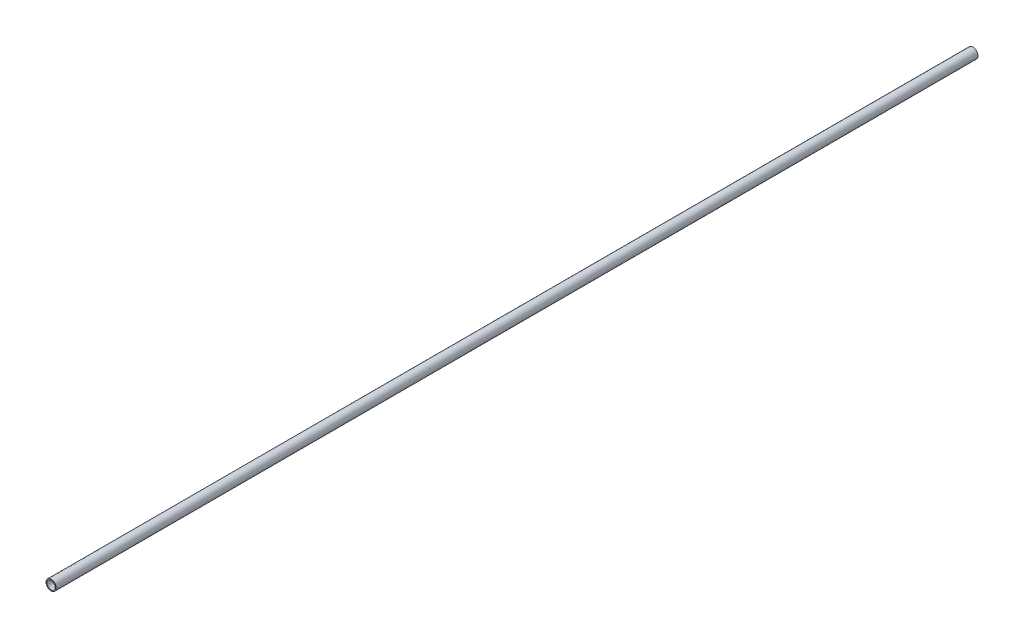
ISO-10303-21;
HEADER;
FILE_DESCRIPTION(('STEP AP214'),'2;1');
FILE_NAME('part.step','',(''),(''),'','','');
FILE_SCHEMA(('AUTOMOTIVE_DESIGN { 1 0 10303 214 1 1 1 1 }'));
ENDSEC;
DATA;
#1=APPLICATION_CONTEXT('core data for automotive mechanical design processes');
#2=APPLICATION_PROTOCOL_DEFINITION('international standard','automotive_design',2000,#1);
#3=PRODUCT_CONTEXT('',#1,'mechanical');
#4=PRODUCT('Part','Part','',(#3));
#5=PRODUCT_RELATED_PRODUCT_CATEGORY('part','',(#4));
#6=PRODUCT_DEFINITION_FORMATION('','',#4);
#7=PRODUCT_DEFINITION_CONTEXT('part definition',#1,'design');
#8=PRODUCT_DEFINITION('design','',#6,#7);
#9=PRODUCT_DEFINITION_SHAPE('','',#8);
#10=(LENGTH_UNIT() NAMED_UNIT(*) SI_UNIT(.MILLI.,.METRE.));
#11=(NAMED_UNIT(*) PLANE_ANGLE_UNIT() SI_UNIT($,.RADIAN.));
#12=(NAMED_UNIT(*) SI_UNIT($,.STERADIAN.) SOLID_ANGLE_UNIT());
#13=UNCERTAINTY_MEASURE_WITH_UNIT(LENGTH_MEASURE(1.E-05),#10,'distance_accuracy_value','');
#14=(GEOMETRIC_REPRESENTATION_CONTEXT(3) GLOBAL_UNCERTAINTY_ASSIGNED_CONTEXT((#13)) GLOBAL_UNIT_ASSIGNED_CONTEXT((#10,
#11,#12)) REPRESENTATION_CONTEXT('',''));
#15=CARTESIAN_POINT('',(0.,0.,0.));
#16=DIRECTION('',(0.,0.,1.));
#17=DIRECTION('',(1.,0.,0.));
#18=AXIS2_PLACEMENT_3D('',#15,#16,#17);
#19=CARTESIAN_POINT('',(0.,0.,1000.));
#20=DIRECTION('',(0.,0.,1.));
#21=DIRECTION('',(1.,0.,0.));
#22=AXIS2_PLACEMENT_3D('',#19,#20,#21);
#23=PLANE('',#22);
#24=CARTESIAN_POINT('',(0.,0.,1000.));
#25=DIRECTION('',(0.,0.,1.));
#26=DIRECTION('',(1.,0.,0.));
#27=AXIS2_PLACEMENT_3D('',#24,#25,#26);
#28=CIRCLE('',#27,5.5);
#29=CARTESIAN_POINT('',(5.5,0.,1000.));
#30=VERTEX_POINT('',#29);
#31=EDGE_CURVE('E10',#30,#30,#28,.T.);
#32=ORIENTED_EDGE('',*,*,#31,.T.);
#33=EDGE_LOOP('',(#32));
#34=FACE_BOUND('',#33,.T.);
#35=CARTESIAN_POINT('',(0.,0.,1000.));
#36=DIRECTION('',(0.,0.,1.));
#37=DIRECTION('',(1.,0.,0.));
#38=AXIS2_PLACEMENT_3D('',#35,#36,#37);
#39=CIRCLE('',#38,4.5);
#40=CARTESIAN_POINT('',(4.5,0.,1000.));
#41=VERTEX_POINT('',#40);
#42=EDGE_CURVE('E42',#41,#41,#39,.T.);
#43=ORIENTED_EDGE('',*,*,#42,.F.);
#44=EDGE_LOOP('',(#43));
#45=FACE_BOUND('',#44,.T.);
#46=ADVANCED_FACE('F31',(#34,#45),#23,.T.);
#47=CARTESIAN_POINT('',(0.,0.,0.));
#48=DIRECTION('',(0.,0.,1.));
#49=DIRECTION('',(1.,0.,0.));
#50=AXIS2_PLACEMENT_3D('',#47,#48,#49);
#51=PLANE('',#50);
#52=CARTESIAN_POINT('',(0.,0.,0.));
#53=DIRECTION('',(0.,0.,1.));
#54=DIRECTION('',(1.,0.,0.));
#55=AXIS2_PLACEMENT_3D('',#52,#53,#54);
#56=CIRCLE('',#55,5.5);
#57=CARTESIAN_POINT('',(5.5,0.,0.));
#58=VERTEX_POINT('',#57);
#59=EDGE_CURVE('E35',#58,#58,#56,.T.);
#60=ORIENTED_EDGE('',*,*,#59,.F.);
#61=EDGE_LOOP('',(#60));
#62=FACE_BOUND('',#61,.T.);
#63=CARTESIAN_POINT('',(0.,0.,0.));
#64=DIRECTION('',(0.,0.,1.));
#65=DIRECTION('',(1.,0.,0.));
#66=AXIS2_PLACEMENT_3D('',#63,#64,#65);
#67=CIRCLE('',#66,4.5);
#68=CARTESIAN_POINT('',(4.5,0.,0.));
#69=VERTEX_POINT('',#68);
#70=EDGE_CURVE('E44',#69,#69,#67,.T.);
#71=ORIENTED_EDGE('',*,*,#70,.T.);
#72=EDGE_LOOP('',(#71));
#73=FACE_BOUND('',#72,.T.);
#74=ADVANCED_FACE('F54',(#62,#73),#51,.F.);
#75=CARTESIAN_POINT('',(0.,0.,1000.));
#76=DIRECTION('',(0.,0.,-1.));
#77=DIRECTION('',(-1.,0.,0.));
#78=AXIS2_PLACEMENT_3D('',#75,#76,#77);
#79=CYLINDRICAL_SURFACE('',#78,5.5);
#80=ORIENTED_EDGE('',*,*,#31,.F.);
#81=EDGE_LOOP('',(#80));
#82=FACE_BOUND('',#81,.T.);
#83=ORIENTED_EDGE('',*,*,#59,.T.);
#84=EDGE_LOOP('',(#83));
#85=FACE_BOUND('',#84,.T.);
#86=ADVANCED_FACE('F33',(#82,#85),#79,.T.);
#87=CARTESIAN_POINT('',(0.,0.,1000.));
#88=DIRECTION('',(0.,0.,-1.));
#89=DIRECTION('',(-1.,0.,0.));
#90=AXIS2_PLACEMENT_3D('',#87,#88,#89);
#91=CYLINDRICAL_SURFACE('',#90,4.5);
#92=ORIENTED_EDGE('',*,*,#42,.T.);
#93=EDGE_LOOP('',(#92));
#94=FACE_BOUND('',#93,.T.);
#95=ORIENTED_EDGE('',*,*,#70,.F.);
#96=EDGE_LOOP('',(#95));
#97=FACE_BOUND('',#96,.T.);
#98=ADVANCED_FACE('F50',(#94,#97),#91,.F.);
#99=CLOSED_SHELL('',(#46,#74,#86,#98));
#100=MANIFOLD_SOLID_BREP('B2',#99);
#101=ADVANCED_BREP_SHAPE_REPRESENTATION('',(#18,#100),#14);
#102=SHAPE_DEFINITION_REPRESENTATION(#9,#101);
ENDSEC;
END-ISO-10303-21;
